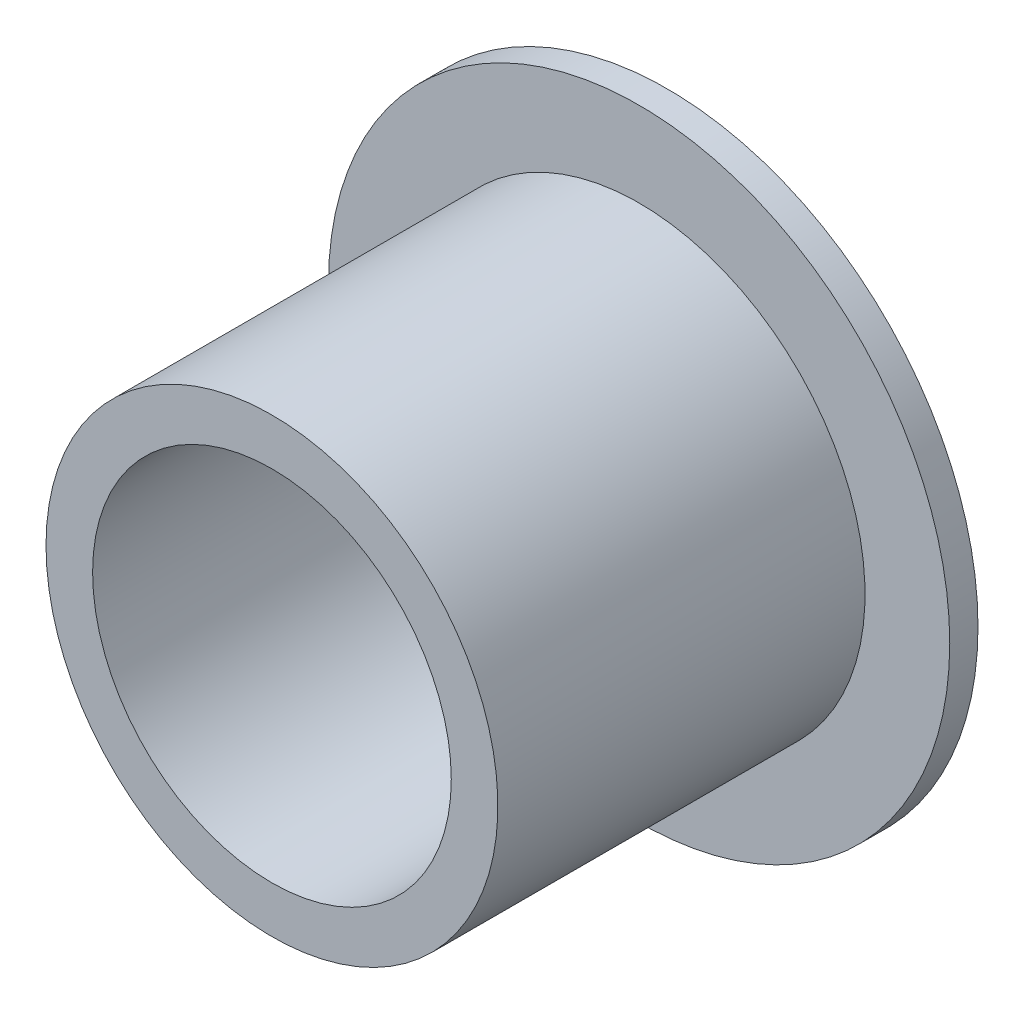
ISO-10303-21;
HEADER;
FILE_DESCRIPTION(('STEP AP214'),'2;1');
FILE_NAME('part.step','',(''),(''),'','','');
FILE_SCHEMA(('AUTOMOTIVE_DESIGN { 1 0 10303 214 1 1 1 1 }'));
ENDSEC;
DATA;
#1=APPLICATION_CONTEXT('core data for automotive mechanical design processes');
#2=APPLICATION_PROTOCOL_DEFINITION('international standard','automotive_design',2000,#1);
#3=PRODUCT_CONTEXT('',#1,'mechanical');
#4=PRODUCT('Part','Part','',(#3));
#5=PRODUCT_RELATED_PRODUCT_CATEGORY('part','',(#4));
#6=PRODUCT_DEFINITION_FORMATION('','',#4);
#7=PRODUCT_DEFINITION_CONTEXT('part definition',#1,'design');
#8=PRODUCT_DEFINITION('design','',#6,#7);
#9=PRODUCT_DEFINITION_SHAPE('','',#8);
#10=(LENGTH_UNIT() NAMED_UNIT(*) SI_UNIT(.MILLI.,.METRE.));
#11=(NAMED_UNIT(*) PLANE_ANGLE_UNIT() SI_UNIT($,.RADIAN.));
#12=(NAMED_UNIT(*) SI_UNIT($,.STERADIAN.) SOLID_ANGLE_UNIT());
#13=UNCERTAINTY_MEASURE_WITH_UNIT(LENGTH_MEASURE(1.E-05),#10,'distance_accuracy_value','');
#14=(GEOMETRIC_REPRESENTATION_CONTEXT(3) GLOBAL_UNCERTAINTY_ASSIGNED_CONTEXT((#13)) GLOBAL_UNIT_ASSIGNED_CONTEXT((#10,
#11,#12)) REPRESENTATION_CONTEXT('',''));
#15=CARTESIAN_POINT('',(0.,0.,0.));
#16=DIRECTION('',(0.,0.,1.));
#17=DIRECTION('',(1.,0.,0.));
#18=AXIS2_PLACEMENT_3D('',#15,#16,#17);
#19=CARTESIAN_POINT('',(0.,0.,0.));
#20=DIRECTION('',(0.,0.,-1.));
#21=DIRECTION('',(-1.,0.,0.));
#22=AXIS2_PLACEMENT_3D('',#19,#20,#21);
#23=CYLINDRICAL_SURFACE('',#22,11.);
#24=CARTESIAN_POINT('',(0.,0.,0.999999999999995));
#25=DIRECTION('',(0.,0.,-1.));
#26=DIRECTION('',(-1.,0.,0.));
#27=AXIS2_PLACEMENT_3D('',#24,#25,#26);
#28=CIRCLE('',#27,11.);
#29=CARTESIAN_POINT('',(-11.,0.,0.999999999999995));
#30=VERTEX_POINT('',#29);
#31=EDGE_CURVE('E10',#30,#30,#28,.T.);
#32=ORIENTED_EDGE('',*,*,#31,.T.);
#33=EDGE_LOOP('',(#32));
#34=FACE_BOUND('',#33,.T.);
#35=CARTESIAN_POINT('',(0.,0.,0.));
#36=DIRECTION('',(0.,0.,-1.));
#37=DIRECTION('',(-1.,0.,0.));
#38=AXIS2_PLACEMENT_3D('',#35,#36,#37);
#39=CIRCLE('',#38,11.);
#40=CARTESIAN_POINT('',(-11.,0.,0.));
#41=VERTEX_POINT('',#40);
#42=EDGE_CURVE('E60',#41,#41,#39,.T.);
#43=ORIENTED_EDGE('',*,*,#42,.F.);
#44=EDGE_LOOP('',(#43));
#45=FACE_BOUND('',#44,.T.);
#46=ADVANCED_FACE('F38',(#34,#45),#23,.T.);
#47=CARTESIAN_POINT('',(0.,11.,0.999999999999996));
#48=DIRECTION('',(0.,0.,1.));
#49=DIRECTION('',(1.,0.,0.));
#50=AXIS2_PLACEMENT_3D('',#47,#48,#49);
#51=PLANE('',#50);
#52=CARTESIAN_POINT('',(0.,0.,0.999999999999996));
#53=DIRECTION('',(0.,0.,-1.));
#54=DIRECTION('',(-1.,0.,0.));
#55=AXIS2_PLACEMENT_3D('',#52,#53,#54);
#56=CIRCLE('',#55,8.);
#57=CARTESIAN_POINT('',(-8.,0.,0.999999999999996));
#58=VERTEX_POINT('',#57);
#59=EDGE_CURVE('E44',#58,#58,#56,.T.);
#60=ORIENTED_EDGE('',*,*,#59,.T.);
#61=EDGE_LOOP('',(#60));
#62=FACE_BOUND('',#61,.T.);
#63=ORIENTED_EDGE('',*,*,#31,.F.);
#64=EDGE_LOOP('',(#63));
#65=FACE_BOUND('',#64,.T.);
#66=ADVANCED_FACE('F68',(#62,#65),#51,.T.);
#67=CARTESIAN_POINT('',(0.,0.,0.));
#68=DIRECTION('',(0.,0.,-1.));
#69=DIRECTION('',(-1.,0.,0.));
#70=AXIS2_PLACEMENT_3D('',#67,#68,#69);
#71=CYLINDRICAL_SURFACE('',#70,8.);
#72=CARTESIAN_POINT('',(0.,0.,14.));
#73=DIRECTION('',(0.,0.,-1.));
#74=DIRECTION('',(-1.,0.,0.));
#75=AXIS2_PLACEMENT_3D('',#72,#73,#74);
#76=CIRCLE('',#75,8.);
#77=CARTESIAN_POINT('',(-8.,0.,14.));
#78=VERTEX_POINT('',#77);
#79=EDGE_CURVE('E48',#78,#78,#76,.T.);
#80=ORIENTED_EDGE('',*,*,#79,.T.);
#81=EDGE_LOOP('',(#80));
#82=FACE_BOUND('',#81,.T.);
#83=ORIENTED_EDGE('',*,*,#59,.F.);
#84=EDGE_LOOP('',(#83));
#85=FACE_BOUND('',#84,.T.);
#86=ADVANCED_FACE('F71',(#82,#85),#71,.T.);
#87=CARTESIAN_POINT('',(0.,8.,14.));
#88=DIRECTION('',(0.,0.,1.));
#89=DIRECTION('',(1.,0.,0.));
#90=AXIS2_PLACEMENT_3D('',#87,#88,#89);
#91=PLANE('',#90);
#92=CARTESIAN_POINT('',(0.,0.,14.));
#93=DIRECTION('',(0.,0.,-1.));
#94=DIRECTION('',(-1.,0.,0.));
#95=AXIS2_PLACEMENT_3D('',#92,#93,#94);
#96=CIRCLE('',#95,6.35);
#97=CARTESIAN_POINT('',(-6.35,0.,14.));
#98=VERTEX_POINT('',#97);
#99=EDGE_CURVE('E52',#98,#98,#96,.T.);
#100=ORIENTED_EDGE('',*,*,#99,.T.);
#101=EDGE_LOOP('',(#100));
#102=FACE_BOUND('',#101,.T.);
#103=ORIENTED_EDGE('',*,*,#79,.F.);
#104=EDGE_LOOP('',(#103));
#105=FACE_BOUND('',#104,.T.);
#106=ADVANCED_FACE('F75',(#102,#105),#91,.T.);
#107=CARTESIAN_POINT('',(0.,0.,0.));
#108=DIRECTION('',(0.,0.,-1.));
#109=DIRECTION('',(-1.,0.,0.));
#110=AXIS2_PLACEMENT_3D('',#107,#108,#109);
#111=CYLINDRICAL_SURFACE('',#110,6.35);
#112=CARTESIAN_POINT('',(0.,0.,0.));
#113=DIRECTION('',(0.,0.,-1.));
#114=DIRECTION('',(-1.,0.,0.));
#115=AXIS2_PLACEMENT_3D('',#112,#113,#114);
#116=CIRCLE('',#115,6.35);
#117=CARTESIAN_POINT('',(-6.35,0.,0.));
#118=VERTEX_POINT('',#117);
#119=EDGE_CURVE('E57',#118,#118,#116,.T.);
#120=ORIENTED_EDGE('',*,*,#119,.T.);
#121=EDGE_LOOP('',(#120));
#122=FACE_BOUND('',#121,.T.);
#123=ORIENTED_EDGE('',*,*,#99,.F.);
#124=EDGE_LOOP('',(#123));
#125=FACE_BOUND('',#124,.T.);
#126=ADVANCED_FACE('F82',(#122,#125),#111,.F.);
#127=CARTESIAN_POINT('',(0.,6.35,0.));
#128=DIRECTION('',(0.,0.,-1.));
#129=DIRECTION('',(-1.,0.,0.));
#130=AXIS2_PLACEMENT_3D('',#127,#128,#129);
#131=PLANE('',#130);
#132=ORIENTED_EDGE('',*,*,#42,.T.);
#133=EDGE_LOOP('',(#132));
#134=FACE_BOUND('',#133,.T.);
#135=ORIENTED_EDGE('',*,*,#119,.F.);
#136=EDGE_LOOP('',(#135));
#137=FACE_BOUND('',#136,.T.);
#138=ADVANCED_FACE('F64',(#134,#137),#131,.T.);
#139=CLOSED_SHELL('',(#46,#66,#86,#106,#126,#138));
#140=MANIFOLD_SOLID_BREP('B2',#139);
#141=ADVANCED_BREP_SHAPE_REPRESENTATION('',(#18,#140),#14);
#142=SHAPE_DEFINITION_REPRESENTATION(#9,#141);
ENDSEC;
END-ISO-10303-21;
